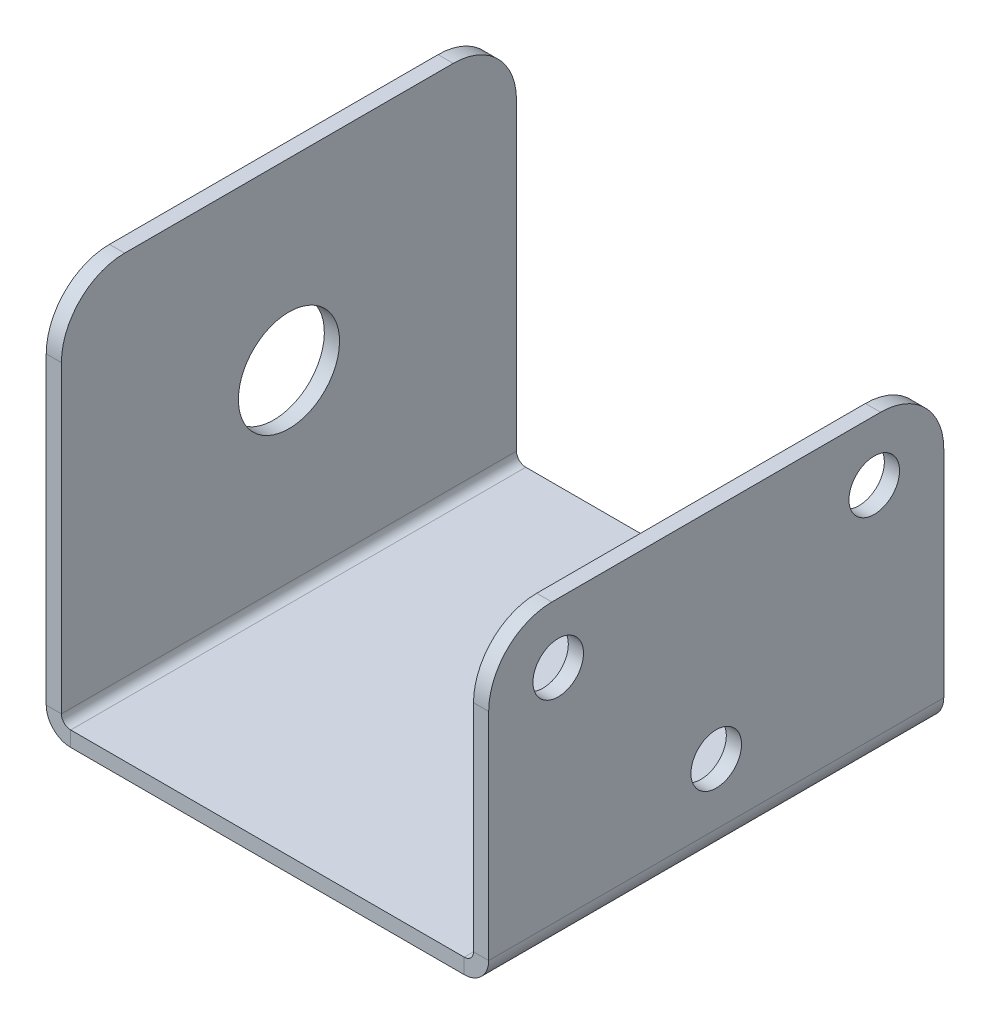
ISO-10303-21;
HEADER;
FILE_DESCRIPTION(('STEP AP214'),'2;1');
FILE_NAME('part.step','',(''),(''),'','','');
FILE_SCHEMA(('AUTOMOTIVE_DESIGN { 1 0 10303 214 1 1 1 1 }'));
ENDSEC;
DATA;
#1=APPLICATION_CONTEXT('core data for automotive mechanical design processes');
#2=APPLICATION_PROTOCOL_DEFINITION('international standard','automotive_design',2000,#1);
#3=PRODUCT_CONTEXT('',#1,'mechanical');
#4=PRODUCT('Part','Part','',(#3));
#5=PRODUCT_RELATED_PRODUCT_CATEGORY('part','',(#4));
#6=PRODUCT_DEFINITION_FORMATION('','',#4);
#7=PRODUCT_DEFINITION_CONTEXT('part definition',#1,'design');
#8=PRODUCT_DEFINITION('design','',#6,#7);
#9=PRODUCT_DEFINITION_SHAPE('','',#8);
#10=(LENGTH_UNIT() NAMED_UNIT(*) SI_UNIT(.MILLI.,.METRE.));
#11=(NAMED_UNIT(*) PLANE_ANGLE_UNIT() SI_UNIT($,.RADIAN.));
#12=(NAMED_UNIT(*) SI_UNIT($,.STERADIAN.) SOLID_ANGLE_UNIT());
#13=UNCERTAINTY_MEASURE_WITH_UNIT(LENGTH_MEASURE(1.E-05),#10,'distance_accuracy_value','');
#14=(GEOMETRIC_REPRESENTATION_CONTEXT(3) GLOBAL_UNCERTAINTY_ASSIGNED_CONTEXT((#13)) GLOBAL_UNIT_ASSIGNED_CONTEXT((#10,
#11,#12)) REPRESENTATION_CONTEXT('',''));
#15=CARTESIAN_POINT('',(0.,0.,0.));
#16=DIRECTION('',(0.,0.,1.));
#17=DIRECTION('',(1.,0.,0.));
#18=AXIS2_PLACEMENT_3D('',#15,#16,#17);
#19=CARTESIAN_POINT('',(17.5000000000001,0.,17.9999999999999));
#20=DIRECTION('',(0.,0.,-1.));
#21=DIRECTION('',(-1.,0.,0.));
#22=AXIS2_PLACEMENT_3D('',#19,#20,#21);
#23=PLANE('',#22);
#24=DIRECTION('',(0.,-1.,0.));
#25=VECTOR('',#24,1.);
#26=CARTESIAN_POINT('',(17.5000000000001,0.,18.0000000000006));
#27=LINE('',#26,#25);
#28=CARTESIAN_POINT('',(17.5000000000001,17.8,17.9999999999999));
#29=VERTEX_POINT('',#28);
#30=CARTESIAN_POINT('',(17.5000000000002,0.736600000000004,17.9999999999999));
#31=VERTEX_POINT('',#30);
#32=EDGE_CURVE('E259',#29,#31,#27,.T.);
#33=ORIENTED_EDGE('',*,*,#32,.F.);
#34=DIRECTION('',(1.,0.,0.));
#35=VECTOR('',#34,1.);
#36=CARTESIAN_POINT('',(16.3000000000001,17.8,18.));
#37=LINE('',#36,#35);
#38=CARTESIAN_POINT('',(16.3000000000001,17.8,18.));
#39=VERTEX_POINT('',#38);
#40=EDGE_CURVE('E326',#29,#39,#37,.F.);
#41=ORIENTED_EDGE('',*,*,#40,.T.);
#42=DIRECTION('',(0.,1.,0.));
#43=VECTOR('',#42,1.);
#44=CARTESIAN_POINT('',(16.3000000000001,0.,18.));
#45=LINE('',#44,#43);
#46=CARTESIAN_POINT('',(16.3000000000001,0.736600000000004,17.9999999999997));
#47=VERTEX_POINT('',#46);
#48=EDGE_CURVE('E264',#39,#47,#45,.F.);
#49=ORIENTED_EDGE('',*,*,#48,.T.);
#50=DIRECTION('',(-1.,0.,0.));
#51=VECTOR('',#50,1.);
#52=CARTESIAN_POINT('',(17.5000000000002,0.736600000000004,17.9999999999999));
#53=LINE('',#52,#51);
#54=EDGE_CURVE('E253',#47,#31,#53,.F.);
#55=ORIENTED_EDGE('',*,*,#54,.T.);
#56=EDGE_LOOP('',(#33,#41,#49,#55));
#57=FACE_BOUND('',#56,.T.);
#58=ADVANCED_FACE('F80',(#57),#23,.F.);
#59=CARTESIAN_POINT('',(17.5000000000001,29.8,-18.));
#60=DIRECTION('',(0.,0.,1.));
#61=DIRECTION('',(0.,-1.,0.));
#62=AXIS2_PLACEMENT_3D('',#59,#60,#61);
#63=PLANE('',#62);
#64=DIRECTION('',(0.,-1.,0.));
#65=VECTOR('',#64,1.);
#66=CARTESIAN_POINT('',(16.3000000000001,29.7999999999999,-18.0000000000002));
#67=LINE('',#66,#65);
#68=CARTESIAN_POINT('',(16.3000000000002,0.736600000000087,-18.0000000000009));
#69=VERTEX_POINT('',#68);
#70=CARTESIAN_POINT('',(16.3000000000001,17.7999999999999,-18.));
#71=VERTEX_POINT('',#70);
#72=EDGE_CURVE('E261',#69,#71,#67,.F.);
#73=ORIENTED_EDGE('',*,*,#72,.T.);
#74=DIRECTION('',(1.,0.,0.));
#75=VECTOR('',#74,1.);
#76=CARTESIAN_POINT('',(17.5000000000012,17.8000000000006,-17.9999999999999));
#77=LINE('',#76,#75);
#78=CARTESIAN_POINT('',(17.5000000000012,17.8000000000006,-17.9999999999999));
#79=VERTEX_POINT('',#78);
#80=EDGE_CURVE('E306',#71,#79,#77,.T.);
#81=ORIENTED_EDGE('',*,*,#80,.T.);
#82=DIRECTION('',(0.,1.,0.));
#83=VECTOR('',#82,1.);
#84=CARTESIAN_POINT('',(17.5,-1.38777878078145E-13,-17.9999999999998));
#85=LINE('',#84,#83);
#86=CARTESIAN_POINT('',(17.4999999999999,0.736599999999893,-18.0000000000001));
#87=VERTEX_POINT('',#86);
#88=EDGE_CURVE('E255',#87,#79,#85,.T.);
#89=ORIENTED_EDGE('',*,*,#88,.F.);
#90=DIRECTION('',(-1.,0.,0.));
#91=VECTOR('',#90,1.);
#92=CARTESIAN_POINT('',(16.3000000000002,0.736600000000087,-18.0000000000009));
#93=LINE('',#92,#91);
#94=EDGE_CURVE('E269',#69,#87,#93,.F.);
#95=ORIENTED_EDGE('',*,*,#94,.F.);
#96=EDGE_LOOP('',(#73,#81,#89,#95));
#97=FACE_BOUND('',#96,.T.);
#98=ADVANCED_FACE('F439',(#97),#63,.F.);
#99=CARTESIAN_POINT('',(17.4999999999999,0.,0.));
#100=DIRECTION('',(-1.,0.,0.));
#101=DIRECTION('',(0.,-1.,0.));
#102=AXIS2_PLACEMENT_3D('',#99,#100,#101);
#103=PLANE('',#102);
#104=CARTESIAN_POINT('',(17.5,5.54999999999994,0.));
#105=DIRECTION('',(1.,0.,0.));
#106=DIRECTION('',(0.,1.,0.));
#107=AXIS2_PLACEMENT_3D('',#104,#105,#106);
#108=CIRCLE('',#107,2.);
#109=CARTESIAN_POINT('',(17.5,7.54999999999994,0.));
#110=VERTEX_POINT('',#109);
#111=EDGE_CURVE('E414',#110,#110,#108,.T.);
#112=ORIENTED_EDGE('',*,*,#111,.F.);
#113=EDGE_LOOP('',(#112));
#114=FACE_BOUND('',#113,.T.);
#115=CARTESIAN_POINT('',(17.5000000000002,18.0500000000001,12.500000000001));
#116=DIRECTION('',(1.,0.,0.));
#117=DIRECTION('',(0.,1.,0.));
#118=AXIS2_PLACEMENT_3D('',#115,#116,#117);
#119=CIRCLE('',#118,2.);
#120=CARTESIAN_POINT('',(17.5000000000002,20.0500000000001,12.500000000001));
#121=VERTEX_POINT('',#120);
#122=EDGE_CURVE('E406',#121,#121,#119,.T.);
#123=ORIENTED_EDGE('',*,*,#122,.F.);
#124=EDGE_LOOP('',(#123));
#125=FACE_BOUND('',#124,.T.);
#126=CARTESIAN_POINT('',(17.5,18.05,-12.5));
#127=DIRECTION('',(1.,0.,0.));
#128=DIRECTION('',(0.,1.,0.));
#129=AXIS2_PLACEMENT_3D('',#126,#127,#128);
#130=CIRCLE('',#129,2.);
#131=CARTESIAN_POINT('',(17.5,20.05,-12.5));
#132=VERTEX_POINT('',#131);
#133=EDGE_CURVE('E407',#132,#132,#130,.T.);
#134=ORIENTED_EDGE('',*,*,#133,.F.);
#135=EDGE_LOOP('',(#134));
#136=FACE_BOUND('',#135,.T.);
#137=ORIENTED_EDGE('',*,*,#88,.T.);
#138=CARTESIAN_POINT('',(17.5000000000002,17.7999999999999,-13.0000000000001));
#139=DIRECTION('',(-1.,0.,0.));
#140=DIRECTION('',(0.,-1.,0.));
#141=AXIS2_PLACEMENT_3D('',#138,#139,#140);
#142=CIRCLE('',#141,5.);
#143=CARTESIAN_POINT('',(17.5,22.8000000000001,-13.0000000000001));
#144=VERTEX_POINT('',#143);
#145=EDGE_CURVE('E315',#79,#144,#142,.F.);
#146=ORIENTED_EDGE('',*,*,#145,.T.);
#147=DIRECTION('',(0.,0.,1.));
#148=VECTOR('',#147,1.);
#149=CARTESIAN_POINT('',(17.5,22.8,-1.11022302462516E-13));
#150=LINE('',#149,#148);
#151=CARTESIAN_POINT('',(17.5,22.8,12.9999999999998));
#152=VERTEX_POINT('',#151);
#153=EDGE_CURVE('E240',#144,#152,#150,.T.);
#154=ORIENTED_EDGE('',*,*,#153,.T.);
#155=CARTESIAN_POINT('',(17.5000000000003,17.8000000000001,13.0000000000008));
#156=DIRECTION('',(-1.,0.,0.));
#157=DIRECTION('',(0.,-1.,0.));
#158=AXIS2_PLACEMENT_3D('',#155,#156,#157);
#159=CIRCLE('',#158,5.);
#160=EDGE_CURVE('E313',#152,#29,#159,.F.);
#161=ORIENTED_EDGE('',*,*,#160,.T.);
#162=ORIENTED_EDGE('',*,*,#32,.T.);
#163=DIRECTION('',(0.,0.,-1.));
#164=VECTOR('',#163,1.);
#165=CARTESIAN_POINT('',(17.5000000000002,0.736600000000004,17.9999999999999));
#166=LINE('',#165,#164);
#167=EDGE_CURVE('E266',#87,#31,#166,.F.);
#168=ORIENTED_EDGE('',*,*,#167,.F.);
#169=EDGE_LOOP('',(#137,#146,#154,#161,#162,#168));
#170=FACE_BOUND('',#169,.T.);
#171=ADVANCED_FACE('F399',(#114,#125,#136,#170),#103,.F.);
#172=CARTESIAN_POINT('',(16.3,0.,5.55111512312578E-13));
#173=DIRECTION('',(-1.,0.,0.));
#174=DIRECTION('',(0.,-1.,0.));
#175=AXIS2_PLACEMENT_3D('',#172,#173,#174);
#176=PLANE('',#175);
#177=CARTESIAN_POINT('',(16.3,5.54999999999994,0.));
#178=DIRECTION('',(-1.,0.,0.));
#179=DIRECTION('',(0.,-1.,0.));
#180=AXIS2_PLACEMENT_3D('',#177,#178,#179);
#181=CIRCLE('',#180,2.);
#182=CARTESIAN_POINT('',(16.3,3.54999999999994,0.));
#183=VERTEX_POINT('',#182);
#184=EDGE_CURVE('E401',#183,#183,#181,.F.);
#185=ORIENTED_EDGE('',*,*,#184,.T.);
#186=EDGE_LOOP('',(#185));
#187=FACE_BOUND('',#186,.T.);
#188=CARTESIAN_POINT('',(16.3000000000001,18.0500000000001,12.5000000000003));
#189=DIRECTION('',(-1.,0.,0.));
#190=DIRECTION('',(0.,-1.,0.));
#191=AXIS2_PLACEMENT_3D('',#188,#189,#190);
#192=CIRCLE('',#191,2.);
#193=CARTESIAN_POINT('',(16.3000000000001,16.0500000000001,12.5000000000003));
#194=VERTEX_POINT('',#193);
#195=EDGE_CURVE('E411',#194,#194,#192,.F.);
#196=ORIENTED_EDGE('',*,*,#195,.T.);
#197=EDGE_LOOP('',(#196));
#198=FACE_BOUND('',#197,.T.);
#199=CARTESIAN_POINT('',(16.3000000000002,18.0499999999999,-12.4999999999997));
#200=DIRECTION('',(-1.,0.,0.));
#201=DIRECTION('',(0.,-1.,0.));
#202=AXIS2_PLACEMENT_3D('',#199,#200,#201);
#203=CIRCLE('',#202,2.);
#204=CARTESIAN_POINT('',(16.3000000000002,16.0499999999999,-12.4999999999997));
#205=VERTEX_POINT('',#204);
#206=EDGE_CURVE('E403',#205,#205,#203,.F.);
#207=ORIENTED_EDGE('',*,*,#206,.T.);
#208=EDGE_LOOP('',(#207));
#209=FACE_BOUND('',#208,.T.);
#210=DIRECTION('',(0.,0.,1.));
#211=VECTOR('',#210,1.);
#212=CARTESIAN_POINT('',(16.3,22.8,-1.11022302462516E-13));
#213=LINE('',#212,#211);
#214=CARTESIAN_POINT('',(16.3000000000001,22.8000000000001,-13.0000000000001));
#215=VERTEX_POINT('',#214);
#216=CARTESIAN_POINT('',(16.3000000000001,22.8,13.0000000000005));
#217=VERTEX_POINT('',#216);
#218=EDGE_CURVE('E397',#215,#217,#213,.T.);
#219=ORIENTED_EDGE('',*,*,#218,.F.);
#220=CARTESIAN_POINT('',(16.3000000000001,17.8,-13.0000000000003));
#221=DIRECTION('',(-1.,0.,0.));
#222=DIRECTION('',(0.,-1.,0.));
#223=AXIS2_PLACEMENT_3D('',#220,#221,#222);
#224=CIRCLE('',#223,5.);
#225=EDGE_CURVE('E324',#215,#71,#224,.T.);
#226=ORIENTED_EDGE('',*,*,#225,.T.);
#227=ORIENTED_EDGE('',*,*,#72,.F.);
#228=DIRECTION('',(0.,0.,-1.));
#229=VECTOR('',#228,1.);
#230=CARTESIAN_POINT('',(16.3000000000001,0.736600000000004,17.9999999999997));
#231=LINE('',#230,#229);
#232=EDGE_CURVE('E272',#47,#69,#231,.T.);
#233=ORIENTED_EDGE('',*,*,#232,.F.);
#234=ORIENTED_EDGE('',*,*,#48,.F.);
#235=CARTESIAN_POINT('',(16.3000000000001,17.8,13.));
#236=DIRECTION('',(-1.,0.,0.));
#237=DIRECTION('',(0.,-1.,0.));
#238=AXIS2_PLACEMENT_3D('',#235,#236,#237);
#239=CIRCLE('',#238,5.);
#240=EDGE_CURVE('E322',#39,#217,#239,.T.);
#241=ORIENTED_EDGE('',*,*,#240,.T.);
#242=EDGE_LOOP('',(#219,#226,#227,#233,#234,#241));
#243=FACE_BOUND('',#242,.T.);
#244=ADVANCED_FACE('F386',(#187,#198,#209,#243),#176,.T.);
#245=CARTESIAN_POINT('',(0.,-1.20000000000006,0.));
#246=DIRECTION('',(0.,-1.,0.));
#247=DIRECTION('',(0.,0.,-1.));
#248=AXIS2_PLACEMENT_3D('',#245,#246,#247);
#249=PLANE('',#248);
#250=DIRECTION('',(1.,0.,0.));
#251=VECTOR('',#250,1.);
#252=CARTESIAN_POINT('',(-17.5,-1.20000000000009,18.0000000000005));
#253=LINE('',#252,#251);
#254=CARTESIAN_POINT('',(-15.5633999999999,-1.20000000000012,17.9999999999999));
#255=VERTEX_POINT('',#254);
#256=CARTESIAN_POINT('',(15.5633999999999,-1.20000000000003,18.));
#257=VERTEX_POINT('',#256);
#258=EDGE_CURVE('E302',#255,#257,#253,.T.);
#259=ORIENTED_EDGE('',*,*,#258,.F.);
#260=DIRECTION('',(0.,0.,1.));
#261=VECTOR('',#260,1.);
#262=CARTESIAN_POINT('',(-15.5633999999999,-1.20000000000012,17.9999999999999));
#263=LINE('',#262,#261);
#264=CARTESIAN_POINT('',(-15.5634,-1.19999999999998,-17.9999999999996));
#265=VERTEX_POINT('',#264);
#266=EDGE_CURVE('E202',#255,#265,#263,.F.);
#267=ORIENTED_EDGE('',*,*,#266,.T.);
#268=DIRECTION('',(-1.,0.,0.));
#269=VECTOR('',#268,1.);
#270=CARTESIAN_POINT('',(-17.5,-1.19999999999998,-18.));
#271=LINE('',#270,#269);
#272=CARTESIAN_POINT('',(15.5634,-1.20000000000001,-18.));
#273=VERTEX_POINT('',#272);
#274=EDGE_CURVE('E299',#273,#265,#271,.T.);
#275=ORIENTED_EDGE('',*,*,#274,.F.);
#276=DIRECTION('',(0.,0.,-1.));
#277=VECTOR('',#276,1.);
#278=CARTESIAN_POINT('',(15.5634,-1.20000000000001,-18.));
#279=LINE('',#278,#277);
#280=EDGE_CURVE('E276',#273,#257,#279,.F.);
#281=ORIENTED_EDGE('',*,*,#280,.T.);
#282=EDGE_LOOP('',(#259,#267,#275,#281));
#283=FACE_BOUND('',#282,.T.);
#284=ADVANCED_FACE('F460',(#283),#249,.T.);
#285=CARTESIAN_POINT('',(0.,0.,0.));
#286=DIRECTION('',(0.,-1.,0.));
#287=DIRECTION('',(0.,0.,-1.));
#288=AXIS2_PLACEMENT_3D('',#285,#286,#287);
#289=PLANE('',#288);
#290=DIRECTION('',(0.,0.,1.));
#291=VECTOR('',#290,1.);
#292=CARTESIAN_POINT('',(-15.5633999999998,1.11022302462516E-13,17.9999999999992));
#293=LINE('',#292,#291);
#294=CARTESIAN_POINT('',(-15.5633999999998,1.11022302462516E-13,17.9999999999992));
#295=VERTEX_POINT('',#294);
#296=CARTESIAN_POINT('',(-15.5634000000001,-1.11022302462516E-13,-18.));
#297=VERTEX_POINT('',#296);
#298=EDGE_CURVE('E247',#295,#297,#293,.F.);
#299=ORIENTED_EDGE('',*,*,#298,.F.);
#300=DIRECTION('',(1.,0.,0.));
#301=VECTOR('',#300,1.);
#302=CARTESIAN_POINT('',(-17.5,0.,18.));
#303=LINE('',#302,#301);
#304=CARTESIAN_POINT('',(15.5634000000001,0.,17.9999999999999));
#305=VERTEX_POINT('',#304);
#306=EDGE_CURVE('E303',#295,#305,#303,.T.);
#307=ORIENTED_EDGE('',*,*,#306,.T.);
#308=DIRECTION('',(0.,0.,-1.));
#309=VECTOR('',#308,1.);
#310=CARTESIAN_POINT('',(15.5634,0.,-18.0000000000001));
#311=LINE('',#310,#309);
#312=CARTESIAN_POINT('',(15.5634,0.,-18.0000000000001));
#313=VERTEX_POINT('',#312);
#314=EDGE_CURVE('E289',#313,#305,#311,.F.);
#315=ORIENTED_EDGE('',*,*,#314,.F.);
#316=DIRECTION('',(-1.,0.,0.));
#317=VECTOR('',#316,1.);
#318=CARTESIAN_POINT('',(-17.5,0.,-18.0000000000001));
#319=LINE('',#318,#317);
#320=EDGE_CURVE('E296',#313,#297,#319,.T.);
#321=ORIENTED_EDGE('',*,*,#320,.T.);
#322=EDGE_LOOP('',(#299,#307,#315,#321));
#323=FACE_BOUND('',#322,.T.);
#324=ADVANCED_FACE('F368',(#323),#289,.F.);
#325=CARTESIAN_POINT('',(-17.5,-1.20000000000009,18.0000000000005));
#326=DIRECTION('',(0.,0.,1.));
#327=DIRECTION('',(1.,0.,0.));
#328=AXIS2_PLACEMENT_3D('',#325,#326,#327);
#329=PLANE('',#328);
#330=ORIENTED_EDGE('',*,*,#306,.F.);
#331=DIRECTION('',(0.,-1.,0.));
#332=VECTOR('',#331,1.);
#333=CARTESIAN_POINT('',(-15.5633999999998,1.11022302462516E-13,17.9999999999992));
#334=LINE('',#333,#332);
#335=EDGE_CURVE('E243',#295,#255,#334,.T.);
#336=ORIENTED_EDGE('',*,*,#335,.T.);
#337=ORIENTED_EDGE('',*,*,#258,.T.);
#338=DIRECTION('',(0.,-1.,0.));
#339=VECTOR('',#338,1.);
#340=CARTESIAN_POINT('',(15.5634000000001,0.,17.9999999999999));
#341=LINE('',#340,#339);
#342=EDGE_CURVE('E293',#305,#257,#341,.T.);
#343=ORIENTED_EDGE('',*,*,#342,.F.);
#344=EDGE_LOOP('',(#330,#336,#337,#343));
#345=FACE_BOUND('',#344,.T.);
#346=ADVANCED_FACE('F466',(#345),#329,.T.);
#347=CARTESIAN_POINT('',(-17.5,-1.19999999999998,-18.));
#348=DIRECTION('',(0.,0.,-1.));
#349=DIRECTION('',(-1.,0.,0.));
#350=AXIS2_PLACEMENT_3D('',#347,#348,#349);
#351=PLANE('',#350);
#352=DIRECTION('',(0.,-1.,0.));
#353=VECTOR('',#352,1.);
#354=CARTESIAN_POINT('',(-15.5634000000001,-1.11022302462516E-13,-18.));
#355=LINE('',#354,#353);
#356=EDGE_CURVE('E250',#297,#265,#355,.T.);
#357=ORIENTED_EDGE('',*,*,#356,.F.);
#358=ORIENTED_EDGE('',*,*,#320,.F.);
#359=DIRECTION('',(0.,-1.,0.));
#360=VECTOR('',#359,1.);
#361=CARTESIAN_POINT('',(15.5634,0.,-18.0000000000001));
#362=LINE('',#361,#360);
#363=EDGE_CURVE('E283',#313,#273,#362,.T.);
#364=ORIENTED_EDGE('',*,*,#363,.T.);
#365=ORIENTED_EDGE('',*,*,#274,.T.);
#366=EDGE_LOOP('',(#357,#358,#364,#365));
#367=FACE_BOUND('',#366,.T.);
#368=ADVANCED_FACE('F364',(#367),#351,.T.);
#369=CARTESIAN_POINT('',(15.5634000000002,0.736600000000143,18.0000000000003));
#370=DIRECTION('',(0.,0.,1.));
#371=DIRECTION('',(1.,0.,0.));
#372=AXIS2_PLACEMENT_3D('',#369,#370,#371);
#373=PLANE('',#372);
#374=ORIENTED_EDGE('',*,*,#54,.F.);
#375=CARTESIAN_POINT('',(15.5634000000002,0.736600000000143,18.0000000000003));
#376=DIRECTION('',(0.,0.,-1.));
#377=DIRECTION('',(-1.,0.,0.));
#378=AXIS2_PLACEMENT_3D('',#375,#376,#377);
#379=CIRCLE('',#378,0.7366);
#380=EDGE_CURVE('E286',#305,#47,#379,.F.);
#381=ORIENTED_EDGE('',*,*,#380,.F.);
#382=ORIENTED_EDGE('',*,*,#342,.T.);
#383=CARTESIAN_POINT('',(15.5634000000002,0.736600000000143,18.0000000000003));
#384=DIRECTION('',(0.,0.,-1.));
#385=DIRECTION('',(-1.,0.,0.));
#386=AXIS2_PLACEMENT_3D('',#383,#384,#385);
#387=CIRCLE('',#386,1.9366);
#388=EDGE_CURVE('E279',#257,#31,#387,.F.);
#389=ORIENTED_EDGE('',*,*,#388,.T.);
#390=EDGE_LOOP('',(#374,#381,#382,#389));
#391=FACE_BOUND('',#390,.T.);
#392=ADVANCED_FACE('F378',(#391),#373,.T.);
#393=CARTESIAN_POINT('',(15.5633999999999,0.736599999999865,-18.0000000000001));
#394=DIRECTION('',(0.,0.,1.));
#395=DIRECTION('',(1.,0.,0.));
#396=AXIS2_PLACEMENT_3D('',#393,#394,#395);
#397=PLANE('',#396);
#398=CARTESIAN_POINT('',(15.5633999999999,0.736599999999865,-18.0000000000001));
#399=DIRECTION('',(0.,0.,-1.));
#400=DIRECTION('',(-1.,0.,0.));
#401=AXIS2_PLACEMENT_3D('',#398,#399,#400);
#402=CIRCLE('',#401,0.7366);
#403=EDGE_CURVE('E258',#69,#313,#402,.T.);
#404=ORIENTED_EDGE('',*,*,#403,.F.);
#405=ORIENTED_EDGE('',*,*,#94,.T.);
#406=CARTESIAN_POINT('',(15.5633999999999,0.736599999999865,-18.0000000000001));
#407=DIRECTION('',(0.,0.,-1.));
#408=DIRECTION('',(-1.,0.,0.));
#409=AXIS2_PLACEMENT_3D('',#406,#407,#408);
#410=CIRCLE('',#409,1.9366);
#411=EDGE_CURVE('E280',#87,#273,#410,.T.);
#412=ORIENTED_EDGE('',*,*,#411,.T.);
#413=ORIENTED_EDGE('',*,*,#363,.F.);
#414=EDGE_LOOP('',(#404,#405,#412,#413));
#415=FACE_BOUND('',#414,.T.);
#416=ADVANCED_FACE('F451',(#415),#397,.F.);
#417=CARTESIAN_POINT('',(15.5633999999999,0.736599999999865,-18.0000000000001));
#418=DIRECTION('',(0.,0.,-1.));
#419=DIRECTION('',(1.,0.,0.));
#420=AXIS2_PLACEMENT_3D('',#417,#418,#419);
#421=CYLINDRICAL_SURFACE('',#420,1.9366);
#422=ORIENTED_EDGE('',*,*,#280,.F.);
#423=ORIENTED_EDGE('',*,*,#411,.F.);
#424=ORIENTED_EDGE('',*,*,#167,.T.);
#425=ORIENTED_EDGE('',*,*,#388,.F.);
#426=EDGE_LOOP('',(#422,#423,#424,#425));
#427=FACE_BOUND('',#426,.T.);
#428=ADVANCED_FACE('F448',(#427),#421,.T.);
#429=CARTESIAN_POINT('',(15.5633999999999,0.736599999999865,-18.0000000000001));
#430=DIRECTION('',(0.,0.,-1.));
#431=DIRECTION('',(1.,0.,0.));
#432=AXIS2_PLACEMENT_3D('',#429,#430,#431);
#433=CYLINDRICAL_SURFACE('',#432,0.7366);
#434=ORIENTED_EDGE('',*,*,#314,.T.);
#435=ORIENTED_EDGE('',*,*,#380,.T.);
#436=ORIENTED_EDGE('',*,*,#232,.T.);
#437=ORIENTED_EDGE('',*,*,#403,.T.);
#438=EDGE_LOOP('',(#434,#435,#436,#437));
#439=FACE_BOUND('',#438,.T.);
#440=ADVANCED_FACE('F373',(#439),#433,.F.);
#441=CARTESIAN_POINT('',(-15.5634000000001,0.736600000000032,-18.));
#442=DIRECTION('',(0.,0.,-1.));
#443=DIRECTION('',(-1.,0.,0.));
#444=AXIS2_PLACEMENT_3D('',#441,#442,#443);
#445=PLANE('',#444);
#446=DIRECTION('',(1.,0.,0.));
#447=VECTOR('',#446,1.);
#448=CARTESIAN_POINT('',(-17.5000000000001,0.736600000000032,-17.9999999999993));
#449=LINE('',#448,#447);
#450=CARTESIAN_POINT('',(-16.3,0.736599999999893,-18.));
#451=VERTEX_POINT('',#450);
#452=CARTESIAN_POINT('',(-17.5000000000001,0.736600000000032,-17.9999999999993));
#453=VERTEX_POINT('',#452);
#454=EDGE_CURVE('E237',#451,#453,#449,.F.);
#455=ORIENTED_EDGE('',*,*,#454,.F.);
#456=CARTESIAN_POINT('',(-15.5634000000001,0.736600000000032,-18.));
#457=DIRECTION('',(0.,0.,1.));
#458=DIRECTION('',(1.,0.,0.));
#459=AXIS2_PLACEMENT_3D('',#456,#457,#458);
#460=CIRCLE('',#459,0.7366);
#461=EDGE_CURVE('E205',#297,#451,#460,.F.);
#462=ORIENTED_EDGE('',*,*,#461,.F.);
#463=ORIENTED_EDGE('',*,*,#356,.T.);
#464=CARTESIAN_POINT('',(-15.5634000000001,0.736600000000032,-18.));
#465=DIRECTION('',(0.,0.,1.));
#466=DIRECTION('',(1.,0.,0.));
#467=AXIS2_PLACEMENT_3D('',#464,#465,#466);
#468=CIRCLE('',#467,1.9366);
#469=EDGE_CURVE('E242',#265,#453,#468,.F.);
#470=ORIENTED_EDGE('',*,*,#469,.T.);
#471=EDGE_LOOP('',(#455,#462,#463,#470));
#472=FACE_BOUND('',#471,.T.);
#473=ADVANCED_FACE('F361',(#472),#445,.T.);
#474=CARTESIAN_POINT('',(-15.5633999999997,0.736600000000087,17.9999999999999));
#475=DIRECTION('',(0.,0.,-1.));
#476=DIRECTION('',(-1.,0.,0.));
#477=AXIS2_PLACEMENT_3D('',#474,#475,#476);
#478=PLANE('',#477);
#479=CARTESIAN_POINT('',(-15.5633999999997,0.736600000000087,17.9999999999999));
#480=DIRECTION('',(0.,0.,1.));
#481=DIRECTION('',(1.,0.,0.));
#482=AXIS2_PLACEMENT_3D('',#479,#480,#481);
#483=CIRCLE('',#482,0.7366);
#484=CARTESIAN_POINT('',(-16.3,0.736599999999948,18.));
#485=VERTEX_POINT('',#484);
#486=EDGE_CURVE('E212',#485,#295,#483,.T.);
#487=ORIENTED_EDGE('',*,*,#486,.F.);
#488=DIRECTION('',(1.,0.,0.));
#489=VECTOR('',#488,1.);
#490=CARTESIAN_POINT('',(-16.3,0.736599999999948,18.));
#491=LINE('',#490,#489);
#492=CARTESIAN_POINT('',(-17.4999999999997,0.736600000000032,18.0000000000002));
#493=VERTEX_POINT('',#492);
#494=EDGE_CURVE('E209',#485,#493,#491,.F.);
#495=ORIENTED_EDGE('',*,*,#494,.T.);
#496=CARTESIAN_POINT('',(-15.5633999999997,0.736600000000087,17.9999999999999));
#497=DIRECTION('',(0.,0.,1.));
#498=DIRECTION('',(1.,0.,0.));
#499=AXIS2_PLACEMENT_3D('',#496,#497,#498);
#500=CIRCLE('',#499,1.9366);
#501=EDGE_CURVE('E195',#493,#255,#500,.T.);
#502=ORIENTED_EDGE('',*,*,#501,.T.);
#503=ORIENTED_EDGE('',*,*,#335,.F.);
#504=EDGE_LOOP('',(#487,#495,#502,#503));
#505=FACE_BOUND('',#504,.T.);
#506=ADVANCED_FACE('F210',(#505),#478,.F.);
#507=CARTESIAN_POINT('',(-15.5633999999997,0.736600000000087,17.9999999999999));
#508=DIRECTION('',(0.,0.,1.));
#509=DIRECTION('',(-1.,0.,0.));
#510=AXIS2_PLACEMENT_3D('',#507,#508,#509);
#511=CYLINDRICAL_SURFACE('',#510,1.9366);
#512=ORIENTED_EDGE('',*,*,#266,.F.);
#513=ORIENTED_EDGE('',*,*,#501,.F.);
#514=DIRECTION('',(0.,0.,1.));
#515=VECTOR('',#514,1.);
#516=CARTESIAN_POINT('',(-17.5000000000001,0.736600000000032,-17.9999999999993));
#517=LINE('',#516,#515);
#518=EDGE_CURVE('E199',#493,#453,#517,.F.);
#519=ORIENTED_EDGE('',*,*,#518,.T.);
#520=ORIENTED_EDGE('',*,*,#469,.F.);
#521=EDGE_LOOP('',(#512,#513,#519,#520));
#522=FACE_BOUND('',#521,.T.);
#523=ADVANCED_FACE('F197',(#522),#511,.T.);
#524=CARTESIAN_POINT('',(-15.5633999999997,0.736600000000087,17.9999999999999));
#525=DIRECTION('',(0.,0.,1.));
#526=DIRECTION('',(-1.,0.,0.));
#527=AXIS2_PLACEMENT_3D('',#524,#525,#526);
#528=CYLINDRICAL_SURFACE('',#527,0.7366);
#529=ORIENTED_EDGE('',*,*,#298,.T.);
#530=ORIENTED_EDGE('',*,*,#461,.T.);
#531=DIRECTION('',(0.,0.,1.));
#532=VECTOR('',#531,1.);
#533=CARTESIAN_POINT('',(-16.3,0.736599999999893,-18.));
#534=LINE('',#533,#532);
#535=EDGE_CURVE('E214',#451,#485,#534,.T.);
#536=ORIENTED_EDGE('',*,*,#535,.T.);
#537=ORIENTED_EDGE('',*,*,#486,.T.);
#538=EDGE_LOOP('',(#529,#530,#536,#537));
#539=FACE_BOUND('',#538,.T.);
#540=ADVANCED_FACE('F356',(#539),#528,.F.);
#541=CARTESIAN_POINT('',(-17.5,0.,-18.0000000000001));
#542=DIRECTION('',(0.,0.,1.));
#543=DIRECTION('',(1.,0.,0.));
#544=AXIS2_PLACEMENT_3D('',#541,#542,#543);
#545=PLANE('',#544);
#546=DIRECTION('',(0.,-1.,0.));
#547=VECTOR('',#546,1.);
#548=CARTESIAN_POINT('',(-17.5,-1.11022302462516E-13,-18.0000000000001));
#549=LINE('',#548,#547);
#550=CARTESIAN_POINT('',(-17.5,24.7999999999999,-18.0000000000002));
#551=VERTEX_POINT('',#550);
#552=EDGE_CURVE('E221',#551,#453,#549,.T.);
#553=ORIENTED_EDGE('',*,*,#552,.F.);
#554=DIRECTION('',(1.,0.,0.));
#555=VECTOR('',#554,1.);
#556=CARTESIAN_POINT('',(-17.5,24.7999999999999,-18.0000000000002));
#557=LINE('',#556,#555);
#558=CARTESIAN_POINT('',(-16.2999999999998,24.7999999999998,-18.0000000000002));
#559=VERTEX_POINT('',#558);
#560=EDGE_CURVE('E328',#551,#559,#557,.T.);
#561=ORIENTED_EDGE('',*,*,#560,.T.);
#562=DIRECTION('',(0.,1.,0.));
#563=VECTOR('',#562,1.);
#564=CARTESIAN_POINT('',(-16.3,0.,-18.));
#565=LINE('',#564,#563);
#566=EDGE_CURVE('E222',#559,#451,#565,.F.);
#567=ORIENTED_EDGE('',*,*,#566,.T.);
#568=ORIENTED_EDGE('',*,*,#454,.T.);
#569=EDGE_LOOP('',(#553,#561,#567,#568));
#570=FACE_BOUND('',#569,.T.);
#571=ADVANCED_FACE('F344',(#570),#545,.F.);
#572=CARTESIAN_POINT('',(-17.4999999999999,29.8,18.0000000000005));
#573=DIRECTION('',(0.,0.,-1.));
#574=DIRECTION('',(0.,1.,0.));
#575=AXIS2_PLACEMENT_3D('',#572,#573,#574);
#576=PLANE('',#575);
#577=DIRECTION('',(0.,-1.,0.));
#578=VECTOR('',#577,1.);
#579=CARTESIAN_POINT('',(-16.3000000000002,29.7999999999999,18.0000000000012));
#580=LINE('',#579,#578);
#581=CARTESIAN_POINT('',(-16.3000000000001,24.7999999999999,17.9999999999999));
#582=VERTEX_POINT('',#581);
#583=EDGE_CURVE('E233',#485,#582,#580,.F.);
#584=ORIENTED_EDGE('',*,*,#583,.T.);
#585=DIRECTION('',(1.,0.,0.));
#586=VECTOR('',#585,1.);
#587=CARTESIAN_POINT('',(-17.5000000000001,24.8,18.));
#588=LINE('',#587,#586);
#589=CARTESIAN_POINT('',(-17.5000000000001,24.8,18.));
#590=VERTEX_POINT('',#589);
#591=EDGE_CURVE('E13',#582,#590,#588,.F.);
#592=ORIENTED_EDGE('',*,*,#591,.T.);
#593=DIRECTION('',(0.,1.,0.));
#594=VECTOR('',#593,1.);
#595=CARTESIAN_POINT('',(-17.5,-1.11022302462516E-13,18.));
#596=LINE('',#595,#594);
#597=EDGE_CURVE('E218',#493,#590,#596,.T.);
#598=ORIENTED_EDGE('',*,*,#597,.F.);
#599=ORIENTED_EDGE('',*,*,#494,.F.);
#600=EDGE_LOOP('',(#584,#592,#598,#599));
#601=FACE_BOUND('',#600,.T.);
#602=ADVANCED_FACE('F224',(#601),#576,.F.);
#603=CARTESIAN_POINT('',(-17.5,-1.11022302462516E-13,-2.22044604925031E-13));
#604=DIRECTION('',(1.,0.,0.));
#605=DIRECTION('',(0.,1.,0.));
#606=AXIS2_PLACEMENT_3D('',#603,#604,#605);
#607=PLANE('',#606);
#608=CARTESIAN_POINT('',(-17.5,15.2683,-1.66533453693773E-13));
#609=DIRECTION('',(1.,0.,0.));
#610=DIRECTION('',(0.,1.,0.));
#611=AXIS2_PLACEMENT_3D('',#608,#609,#610);
#612=CIRCLE('',#611,4.);
#613=CARTESIAN_POINT('',(-17.5,19.2683,-1.66533453693773E-13));
#614=VERTEX_POINT('',#613);
#615=EDGE_CURVE('E410',#614,#614,#612,.F.);
#616=ORIENTED_EDGE('',*,*,#615,.F.);
#617=EDGE_LOOP('',(#616));
#618=FACE_BOUND('',#617,.T.);
#619=DIRECTION('',(0.,0.,-1.));
#620=VECTOR('',#619,1.);
#621=CARTESIAN_POINT('',(-17.5,29.7999999999999,2.22044604925031E-13));
#622=LINE('',#621,#620);
#623=CARTESIAN_POINT('',(-17.5,29.8,13.));
#624=VERTEX_POINT('',#623);
#625=CARTESIAN_POINT('',(-17.5,29.7999999999999,-13.));
#626=VERTEX_POINT('',#625);
#627=EDGE_CURVE('E225',#624,#626,#622,.T.);
#628=ORIENTED_EDGE('',*,*,#627,.T.);
#629=CARTESIAN_POINT('',(-17.5000000000002,24.8,-13.));
#630=DIRECTION('',(1.,0.,0.));
#631=DIRECTION('',(0.,1.,0.));
#632=AXIS2_PLACEMENT_3D('',#629,#630,#631);
#633=CIRCLE('',#632,5.);
#634=EDGE_CURVE('E88',#626,#551,#633,.F.);
#635=ORIENTED_EDGE('',*,*,#634,.T.);
#636=ORIENTED_EDGE('',*,*,#552,.T.);
#637=ORIENTED_EDGE('',*,*,#518,.F.);
#638=ORIENTED_EDGE('',*,*,#597,.T.);
#639=CARTESIAN_POINT('',(-17.5000000000001,24.7999999999999,13.));
#640=DIRECTION('',(1.,0.,0.));
#641=DIRECTION('',(0.,1.,0.));
#642=AXIS2_PLACEMENT_3D('',#639,#640,#641);
#643=CIRCLE('',#642,5.);
#644=EDGE_CURVE('E339',#590,#624,#643,.F.);
#645=ORIENTED_EDGE('',*,*,#644,.T.);
#646=EDGE_LOOP('',(#628,#635,#636,#637,#638,#645));
#647=FACE_BOUND('',#646,.T.);
#648=ADVANCED_FACE('F217',(#618,#647),#607,.F.);
#649=CARTESIAN_POINT('',(-16.3,-1.11022302462516E-13,0.));
#650=DIRECTION('',(1.,0.,0.));
#651=DIRECTION('',(0.,1.,0.));
#652=AXIS2_PLACEMENT_3D('',#649,#650,#651);
#653=PLANE('',#652);
#654=CARTESIAN_POINT('',(-16.3,15.2683000000001,1.11022302462516E-13));
#655=DIRECTION('',(1.,0.,0.));
#656=DIRECTION('',(0.,1.,0.));
#657=AXIS2_PLACEMENT_3D('',#654,#655,#656);
#658=CIRCLE('',#657,4.);
#659=CARTESIAN_POINT('',(-16.3,19.2683000000001,1.11022302462516E-13));
#660=VERTEX_POINT('',#659);
#661=EDGE_CURVE('E423',#660,#660,#658,.T.);
#662=ORIENTED_EDGE('',*,*,#661,.F.);
#663=EDGE_LOOP('',(#662));
#664=FACE_BOUND('',#663,.T.);
#665=ORIENTED_EDGE('',*,*,#566,.F.);
#666=CARTESIAN_POINT('',(-16.3,24.7999999999999,-13.));
#667=DIRECTION('',(1.,0.,0.));
#668=DIRECTION('',(0.,1.,0.));
#669=AXIS2_PLACEMENT_3D('',#666,#667,#668);
#670=CIRCLE('',#669,5.);
#671=CARTESIAN_POINT('',(-16.3000000000001,29.7999999999999,-13.0000000000002));
#672=VERTEX_POINT('',#671);
#673=EDGE_CURVE('E333',#559,#672,#670,.T.);
#674=ORIENTED_EDGE('',*,*,#673,.T.);
#675=DIRECTION('',(0.,0.,1.));
#676=VECTOR('',#675,1.);
#677=CARTESIAN_POINT('',(-16.3000000000003,29.8,-18.0000000000002));
#678=LINE('',#677,#676);
#679=CARTESIAN_POINT('',(-16.3000000000003,29.8,13.0000000000012));
#680=VERTEX_POINT('',#679);
#681=EDGE_CURVE('E228',#680,#672,#678,.F.);
#682=ORIENTED_EDGE('',*,*,#681,.F.);
#683=CARTESIAN_POINT('',(-16.2999999999999,24.7999999999999,13.));
#684=DIRECTION('',(1.,0.,0.));
#685=DIRECTION('',(0.,1.,0.));
#686=AXIS2_PLACEMENT_3D('',#683,#684,#685);
#687=CIRCLE('',#686,5.);
#688=EDGE_CURVE('E331',#680,#582,#687,.T.);
#689=ORIENTED_EDGE('',*,*,#688,.T.);
#690=ORIENTED_EDGE('',*,*,#583,.F.);
#691=ORIENTED_EDGE('',*,*,#535,.F.);
#692=EDGE_LOOP('',(#665,#674,#682,#689,#690,#691));
#693=FACE_BOUND('',#692,.T.);
#694=ADVANCED_FACE('F350',(#664,#693),#653,.T.);
#695=CARTESIAN_POINT('',(-17.5000000000001,29.7999999999999,-18.));
#696=DIRECTION('',(0.,-1.,0.));
#697=DIRECTION('',(1.,0.,0.));
#698=AXIS2_PLACEMENT_3D('',#695,#696,#697);
#699=PLANE('',#698);
#700=ORIENTED_EDGE('',*,*,#681,.T.);
#701=DIRECTION('',(1.,0.,0.));
#702=VECTOR('',#701,1.);
#703=CARTESIAN_POINT('',(-17.5,29.7999999999999,-13.));
#704=LINE('',#703,#702);
#705=EDGE_CURVE('E101',#672,#626,#704,.F.);
#706=ORIENTED_EDGE('',*,*,#705,.T.);
#707=ORIENTED_EDGE('',*,*,#627,.F.);
#708=DIRECTION('',(1.,0.,0.));
#709=VECTOR('',#708,1.);
#710=CARTESIAN_POINT('',(-17.5,29.8,13.));
#711=LINE('',#710,#709);
#712=EDGE_CURVE('E335',#624,#680,#711,.T.);
#713=ORIENTED_EDGE('',*,*,#712,.T.);
#714=EDGE_LOOP('',(#700,#706,#707,#713));
#715=FACE_BOUND('',#714,.T.);
#716=ADVANCED_FACE('F352',(#715),#699,.F.);
#717=CARTESIAN_POINT('',(-20.3742416417844,22.8000000000002,-1.66533453693773E-13));
#718=DIRECTION('',(0.,1.,0.));
#719=DIRECTION('',(-1.,0.,0.));
#720=AXIS2_PLACEMENT_3D('',#717,#718,#719);
#721=PLANE('',#720);
#722=ORIENTED_EDGE('',*,*,#153,.F.);
#723=DIRECTION('',(1.,0.,0.));
#724=VECTOR('',#723,1.);
#725=CARTESIAN_POINT('',(16.3000000000001,22.8000000000001,-13.0000000000001));
#726=LINE('',#725,#724);
#727=EDGE_CURVE('E320',#144,#215,#726,.F.);
#728=ORIENTED_EDGE('',*,*,#727,.T.);
#729=ORIENTED_EDGE('',*,*,#218,.T.);
#730=DIRECTION('',(1.,0.,0.));
#731=VECTOR('',#730,1.);
#732=CARTESIAN_POINT('',(17.5,22.8,12.9999999999998));
#733=LINE('',#732,#731);
#734=EDGE_CURVE('E317',#217,#152,#733,.T.);
#735=ORIENTED_EDGE('',*,*,#734,.T.);
#736=EDGE_LOOP('',(#722,#728,#729,#735));
#737=FACE_BOUND('',#736,.T.);
#738=ADVANCED_FACE('F395',(#737),#721,.T.);
#739=CARTESIAN_POINT('',(10.6431457505083,18.0500000000004,-12.4999999999992));
#740=DIRECTION('',(1.,0.,0.));
#741=DIRECTION('',(0.,1.,0.));
#742=AXIS2_PLACEMENT_3D('',#739,#740,#741);
#743=CYLINDRICAL_SURFACE('',#742,2.);
#744=ORIENTED_EDGE('',*,*,#133,.T.);
#745=EDGE_LOOP('',(#744));
#746=FACE_BOUND('',#745,.T.);
#747=ORIENTED_EDGE('',*,*,#206,.F.);
#748=EDGE_LOOP('',(#747));
#749=FACE_BOUND('',#748,.T.);
#750=ADVANCED_FACE('F530',(#746,#749),#743,.F.);
#751=CARTESIAN_POINT('',(10.6431457505078,18.05,12.4999999999998));
#752=DIRECTION('',(1.,0.,0.));
#753=DIRECTION('',(0.,1.,0.));
#754=AXIS2_PLACEMENT_3D('',#751,#752,#753);
#755=CYLINDRICAL_SURFACE('',#754,2.);
#756=ORIENTED_EDGE('',*,*,#122,.T.);
#757=EDGE_LOOP('',(#756));
#758=FACE_BOUND('',#757,.T.);
#759=ORIENTED_EDGE('',*,*,#195,.F.);
#760=EDGE_LOOP('',(#759));
#761=FACE_BOUND('',#760,.T.);
#762=ADVANCED_FACE('F519',(#758,#761),#755,.F.);
#763=CARTESIAN_POINT('',(10.6431457505076,5.54999999999994,-2.77555756156289E-13));
#764=DIRECTION('',(1.,0.,0.));
#765=DIRECTION('',(0.,1.,0.));
#766=AXIS2_PLACEMENT_3D('',#763,#764,#765);
#767=CYLINDRICAL_SURFACE('',#766,2.);
#768=ORIENTED_EDGE('',*,*,#111,.T.);
#769=EDGE_LOOP('',(#768));
#770=FACE_BOUND('',#769,.T.);
#771=ORIENTED_EDGE('',*,*,#184,.F.);
#772=EDGE_LOOP('',(#771));
#773=FACE_BOUND('',#772,.T.);
#774=ADVANCED_FACE('F508',(#770,#773),#767,.F.);
#775=CARTESIAN_POINT('',(-28.8137084989849,15.2683,0.));
#776=DIRECTION('',(1.,0.,0.));
#777=DIRECTION('',(0.,1.,0.));
#778=AXIS2_PLACEMENT_3D('',#775,#776,#777);
#779=CYLINDRICAL_SURFACE('',#778,4.);
#780=ORIENTED_EDGE('',*,*,#615,.T.);
#781=EDGE_LOOP('',(#780));
#782=FACE_BOUND('',#781,.T.);
#783=ORIENTED_EDGE('',*,*,#661,.T.);
#784=EDGE_LOOP('',(#783));
#785=FACE_BOUND('',#784,.T.);
#786=ADVANCED_FACE('F427',(#782,#785),#779,.F.);
#787=CARTESIAN_POINT('',(17.5000000000002,17.7999999999999,-13.0000000000001));
#788=DIRECTION('',(-1.,0.,0.));
#789=DIRECTION('',(0.,-1.,0.));
#790=AXIS2_PLACEMENT_3D('',#787,#788,#789);
#791=CYLINDRICAL_SURFACE('',#790,5.);
#792=ORIENTED_EDGE('',*,*,#225,.F.);
#793=ORIENTED_EDGE('',*,*,#727,.F.);
#794=ORIENTED_EDGE('',*,*,#145,.F.);
#795=ORIENTED_EDGE('',*,*,#80,.F.);
#796=EDGE_LOOP('',(#792,#793,#794,#795));
#797=FACE_BOUND('',#796,.T.);
#798=ADVANCED_FACE('F472',(#797),#791,.T.);
#799=CARTESIAN_POINT('',(-20.3742416417844,17.8000000000002,13.0000000000001));
#800=DIRECTION('',(-1.,0.,0.));
#801=DIRECTION('',(0.,-1.,0.));
#802=AXIS2_PLACEMENT_3D('',#799,#800,#801);
#803=CYLINDRICAL_SURFACE('',#802,5.);
#804=ORIENTED_EDGE('',*,*,#240,.F.);
#805=ORIENTED_EDGE('',*,*,#40,.F.);
#806=ORIENTED_EDGE('',*,*,#160,.F.);
#807=ORIENTED_EDGE('',*,*,#734,.F.);
#808=EDGE_LOOP('',(#804,#805,#806,#807));
#809=FACE_BOUND('',#808,.T.);
#810=ADVANCED_FACE('F391',(#809),#803,.T.);
#811=CARTESIAN_POINT('',(-17.5000000000002,24.8,-13.));
#812=DIRECTION('',(1.,0.,0.));
#813=DIRECTION('',(0.,1.,0.));
#814=AXIS2_PLACEMENT_3D('',#811,#812,#813);
#815=CYLINDRICAL_SURFACE('',#814,5.);
#816=ORIENTED_EDGE('',*,*,#634,.F.);
#817=ORIENTED_EDGE('',*,*,#705,.F.);
#818=ORIENTED_EDGE('',*,*,#673,.F.);
#819=ORIENTED_EDGE('',*,*,#560,.F.);
#820=EDGE_LOOP('',(#816,#817,#818,#819));
#821=FACE_BOUND('',#820,.T.);
#822=ADVANCED_FACE('F347',(#821),#815,.T.);
#823=CARTESIAN_POINT('',(-17.5000000000001,24.7999999999999,13.));
#824=DIRECTION('',(1.,0.,0.));
#825=DIRECTION('',(0.,1.,0.));
#826=AXIS2_PLACEMENT_3D('',#823,#824,#825);
#827=CYLINDRICAL_SURFACE('',#826,5.);
#828=ORIENTED_EDGE('',*,*,#644,.F.);
#829=ORIENTED_EDGE('',*,*,#591,.F.);
#830=ORIENTED_EDGE('',*,*,#688,.F.);
#831=ORIENTED_EDGE('',*,*,#712,.F.);
#832=EDGE_LOOP('',(#828,#829,#830,#831));
#833=FACE_BOUND('',#832,.T.);
#834=ADVANCED_FACE('F82',(#833),#827,.T.);
#835=CLOSED_SHELL('',(#58,#98,#171,#244,#284,#324,#346,#368,#392,#416,#428,#440,#473,#506,#523,
#540,#571,#602,#648,#694,#716,#738,#750,#762,#774,#786,#798,#810,#822,#834));
#836=MANIFOLD_SOLID_BREP('B2',#835);
#837=ADVANCED_BREP_SHAPE_REPRESENTATION('',(#18,#836),#14);
#838=SHAPE_DEFINITION_REPRESENTATION(#9,#837);
ENDSEC;
END-ISO-10303-21;
